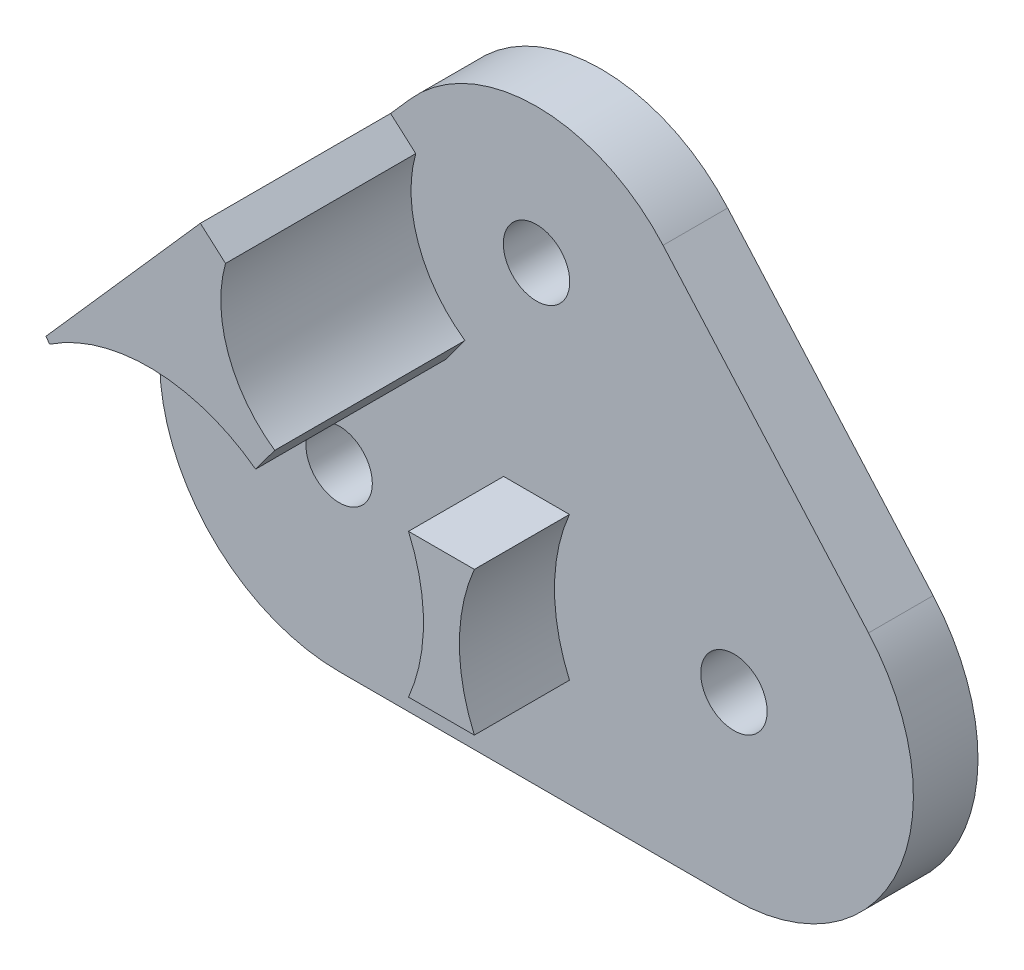
ISO-10303-21;
HEADER;
FILE_DESCRIPTION(('STEP AP214'),'2;1');
FILE_NAME('part.step','',(''),(''),'','','');
FILE_SCHEMA(('AUTOMOTIVE_DESIGN { 1 0 10303 214 1 1 1 1 }'));
ENDSEC;
DATA;
#1=APPLICATION_CONTEXT('core data for automotive mechanical design processes');
#2=APPLICATION_PROTOCOL_DEFINITION('international standard','automotive_design',2000,#1);
#3=PRODUCT_CONTEXT('',#1,'mechanical');
#4=PRODUCT('Part','Part','',(#3));
#5=PRODUCT_RELATED_PRODUCT_CATEGORY('part','',(#4));
#6=PRODUCT_DEFINITION_FORMATION('','',#4);
#7=PRODUCT_DEFINITION_CONTEXT('part definition',#1,'design');
#8=PRODUCT_DEFINITION('design','',#6,#7);
#9=PRODUCT_DEFINITION_SHAPE('','',#8);
#10=(LENGTH_UNIT() NAMED_UNIT(*) SI_UNIT(.MILLI.,.METRE.));
#11=(NAMED_UNIT(*) PLANE_ANGLE_UNIT() SI_UNIT($,.RADIAN.));
#12=(NAMED_UNIT(*) SI_UNIT($,.STERADIAN.) SOLID_ANGLE_UNIT());
#13=UNCERTAINTY_MEASURE_WITH_UNIT(LENGTH_MEASURE(1.E-05),#10,'distance_accuracy_value','');
#14=(GEOMETRIC_REPRESENTATION_CONTEXT(3) GLOBAL_UNCERTAINTY_ASSIGNED_CONTEXT((#13)) GLOBAL_UNIT_ASSIGNED_CONTEXT((#10,
#11,#12)) REPRESENTATION_CONTEXT('',''));
#15=CARTESIAN_POINT('',(0.,0.,0.));
#16=DIRECTION('',(0.,0.,1.));
#17=DIRECTION('',(1.,0.,0.));
#18=AXIS2_PLACEMENT_3D('',#15,#16,#17);
#19=CARTESIAN_POINT('',(2.45,3.25,1.8));
#20=DIRECTION('',(0.,0.,-1.));
#21=DIRECTION('',(-1.,0.,0.));
#22=AXIS2_PLACEMENT_3D('',#19,#20,#21);
#23=CYLINDRICAL_SURFACE('',#22,5.);
#24=DIRECTION('',(0.,0.,1.));
#25=VECTOR('',#24,1.);
#26=CARTESIAN_POINT('',(6.19964646231453,6.5575899696988,0.));
#27=LINE('',#26,#25);
#28=CARTESIAN_POINT('',(6.19964646231453,6.5575899696988,0.));
#29=VERTEX_POINT('',#28);
#30=CARTESIAN_POINT('',(6.19964646231453,6.5575899696988,1.8));
#31=VERTEX_POINT('',#30);
#32=EDGE_CURVE('E243',#29,#31,#27,.T.);
#33=ORIENTED_EDGE('',*,*,#32,.T.);
#34=CARTESIAN_POINT('',(2.45,3.25,1.8));
#35=DIRECTION('',(0.,0.,1.));
#36=DIRECTION('',(1.,0.,0.));
#37=AXIS2_PLACEMENT_3D('',#34,#35,#36);
#38=CIRCLE('',#37,5.);
#39=CARTESIAN_POINT('',(2.45,-1.75,1.8));
#40=VERTEX_POINT('',#39);
#41=EDGE_CURVE('E262',#40,#31,#38,.T.);
#42=ORIENTED_EDGE('',*,*,#41,.F.);
#43=DIRECTION('',(0.,0.,-1.));
#44=VECTOR('',#43,1.);
#45=CARTESIAN_POINT('',(2.45,-1.75,1.8));
#46=LINE('',#45,#44);
#47=CARTESIAN_POINT('',(2.45,-1.75,0.));
#48=VERTEX_POINT('',#47);
#49=EDGE_CURVE('E46',#40,#48,#46,.T.);
#50=ORIENTED_EDGE('',*,*,#49,.T.);
#51=CARTESIAN_POINT('',(2.45,3.25,0.));
#52=DIRECTION('',(0.,0.,1.));
#53=DIRECTION('',(1.,0.,0.));
#54=AXIS2_PLACEMENT_3D('',#51,#52,#53);
#55=CIRCLE('',#54,5.);
#56=EDGE_CURVE('E263',#48,#29,#55,.T.);
#57=ORIENTED_EDGE('',*,*,#56,.T.);
#58=EDGE_LOOP('',(#33,#42,#50,#57));
#59=FACE_BOUND('',#58,.T.);
#60=ADVANCED_FACE('F36',(#59),#23,.T.);
#61=CARTESIAN_POINT('',(-8.55,3.25,1.8));
#62=DIRECTION('',(0.,0.,1.));
#63=DIRECTION('',(1.,0.,0.));
#64=AXIS2_PLACEMENT_3D('',#61,#62,#63);
#65=PLANE('',#64);
#66=CARTESIAN_POINT('',(2.45,3.25,1.8));
#67=DIRECTION('',(0.,0.,1.));
#68=DIRECTION('',(1.,0.,0.));
#69=AXIS2_PLACEMENT_3D('',#66,#67,#68);
#70=CIRCLE('',#69,5.);
#71=CARTESIAN_POINT('',(-2.13257569495584,5.25,1.8));
#72=VERTEX_POINT('',#71);
#73=CARTESIAN_POINT('',(-2.13257569495584,1.25,1.8));
#74=VERTEX_POINT('',#73);
#75=EDGE_CURVE('E157',#72,#74,#70,.T.);
#76=ORIENTED_EDGE('',*,*,#75,.T.);
#77=DIRECTION('',(1.,0.,0.));
#78=VECTOR('',#77,1.);
#79=CARTESIAN_POINT('',(0.,1.25,1.8));
#80=LINE('',#79,#78);
#81=CARTESIAN_POINT('',(-3.96742430504416,1.25,1.8));
#82=VERTEX_POINT('',#81);
#83=EDGE_CURVE('E173',#82,#74,#80,.T.);
#84=ORIENTED_EDGE('',*,*,#83,.F.);
#85=CARTESIAN_POINT('',(-8.55,3.25,1.8));
#86=DIRECTION('',(0.,0.,1.));
#87=DIRECTION('',(1.,0.,0.));
#88=AXIS2_PLACEMENT_3D('',#85,#86,#87);
#89=CIRCLE('',#88,5.);
#90=CARTESIAN_POINT('',(-3.96742430504416,5.25,1.8));
#91=VERTEX_POINT('',#90);
#92=EDGE_CURVE('E54',#82,#91,#89,.T.);
#93=ORIENTED_EDGE('',*,*,#92,.T.);
#94=DIRECTION('',(1.,0.,0.));
#95=VECTOR('',#94,1.);
#96=CARTESIAN_POINT('',(0.,5.25,1.8));
#97=LINE('',#96,#95);
#98=EDGE_CURVE('E183',#91,#72,#97,.T.);
#99=ORIENTED_EDGE('',*,*,#98,.T.);
#100=EDGE_LOOP('',(#76,#84,#93,#99));
#101=FACE_BOUND('',#100,.T.);
#102=DIRECTION('',(0.553999449794571,-0.832517032634956,0.));
#103=VECTOR('',#102,1.);
#104=CARTESIAN_POINT('',(-4.42692798373431,-2.94590449339717,1.8));
#105=LINE('',#104,#103);
#106=CARTESIAN_POINT('',(-11.4169416991755,7.55826744867719,1.8));
#107=VERTEX_POINT('',#106);
#108=CARTESIAN_POINT('',(-11.3199972489729,7.41258516317478,1.8));
#109=VERTEX_POINT('',#108);
#110=EDGE_CURVE('E40',#107,#109,#105,.T.);
#111=ORIENTED_EDGE('',*,*,#110,.F.);
#112=DIRECTION('',(-0.661517993939761,-0.749929292462906,0.));
#113=VECTOR('',#112,1.);
#114=CARTESIAN_POINT('',(-12.2996464623145,6.5575899696988,1.8));
#115=LINE('',#114,#113);
#116=CARTESIAN_POINT('',(-12.2996464623145,6.5575899696988,1.8));
#117=VERTEX_POINT('',#116);
#118=EDGE_CURVE('E249',#107,#117,#115,.T.);
#119=ORIENTED_EDGE('',*,*,#118,.T.);
#120=CARTESIAN_POINT('',(-8.55,3.25,1.8));
#121=DIRECTION('',(0.,0.,1.));
#122=DIRECTION('',(1.,0.,0.));
#123=AXIS2_PLACEMENT_3D('',#120,#121,#122);
#124=CIRCLE('',#123,5.);
#125=CARTESIAN_POINT('',(-8.55,-1.75,1.8));
#126=VERTEX_POINT('',#125);
#127=EDGE_CURVE('E266',#117,#126,#124,.T.);
#128=ORIENTED_EDGE('',*,*,#127,.T.);
#129=DIRECTION('',(1.,0.,0.));
#130=VECTOR('',#129,1.);
#131=CARTESIAN_POINT('',(-8.55,-1.75,1.8));
#132=LINE('',#131,#130);
#133=EDGE_CURVE('E274',#126,#40,#132,.T.);
#134=ORIENTED_EDGE('',*,*,#133,.T.);
#135=ORIENTED_EDGE('',*,*,#41,.T.);
#136=DIRECTION('',(-0.661517993939761,0.749929292462906,0.));
#137=VECTOR('',#136,1.);
#138=CARTESIAN_POINT('',(6.19964646231453,6.5575899696988,1.8));
#139=LINE('',#138,#137);
#140=CARTESIAN_POINT('',(0.474920939683804,13.0474200273249,1.8));
#141=VERTEX_POINT('',#140);
#142=EDGE_CURVE('E231',#31,#141,#139,.T.);
#143=ORIENTED_EDGE('',*,*,#142,.T.);
#144=CARTESIAN_POINT('',(-3.05,9.93806204884429,1.8));
#145=DIRECTION('',(0.,0.,1.));
#146=DIRECTION('',(1.,0.,0.));
#147=AXIS2_PLACEMENT_3D('',#144,#145,#146);
#148=CIRCLE('',#147,4.70033771864987);
#149=CARTESIAN_POINT('',(-6.57492093968381,13.0474200273249,1.8));
#150=VERTEX_POINT('',#149);
#151=EDGE_CURVE('E246',#141,#150,#148,.T.);
#152=ORIENTED_EDGE('',*,*,#151,.T.);
#153=CARTESIAN_POINT('',(-7.11620923440593,12.4337890277177,1.8));
#154=VERTEX_POINT('',#153);
#155=EDGE_CURVE('E238',#150,#154,#115,.T.);
#156=ORIENTED_EDGE('',*,*,#155,.T.);
#157=DIRECTION('',(0.749929292462906,-0.661517993939761,0.));
#158=VECTOR('',#157,1.);
#159=CARTESIAN_POINT('',(3.05420354021843,3.46239515921963,1.8));
#160=LINE('',#159,#158);
#161=CARTESIAN_POINT('',(-6.41511562514768,11.8153493393074,1.8));
#162=VERTEX_POINT('',#161);
#163=EDGE_CURVE('E215',#154,#162,#160,.T.);
#164=ORIENTED_EDGE('',*,*,#163,.T.);
#165=CARTESIAN_POINT('',(-3.05,10.8630620488443,1.8));
#166=DIRECTION('',(0.,0.,1.));
#167=DIRECTION('',(1.,0.,0.));
#168=AXIS2_PLACEMENT_3D('',#165,#166,#167);
#169=CIRCLE('',#168,3.49726382393304);
#170=CARTESIAN_POINT('',(-5.04438407694558,7.99020869236807,1.8));
#171=VERTEX_POINT('',#170);
#172=EDGE_CURVE('E213',#162,#171,#169,.T.);
#173=ORIENTED_EDGE('',*,*,#172,.T.);
#174=DIRECTION('',(-0.594608600812531,-0.804015305724813,0.));
#175=VECTOR('',#174,1.);
#176=CARTESIAN_POINT('',(-7.08080908312888,5.23660426805478,1.8));
#177=LINE('',#176,#175);
#178=CARTESIAN_POINT('',(-5.57695699593735,7.27007652862406,1.8));
#179=VERTEX_POINT('',#178);
#180=EDGE_CURVE('E210',#171,#179,#177,.T.);
#181=ORIENTED_EDGE('',*,*,#180,.T.);
#182=CARTESIAN_POINT('',(-8.55,3.25,1.8));
#183=DIRECTION('',(0.,0.,1.));
#184=DIRECTION('',(1.,0.,0.));
#185=AXIS2_PLACEMENT_3D('',#182,#183,#184);
#186=CIRCLE('',#185,5.);
#187=EDGE_CURVE('E62',#179,#109,#186,.T.);
#188=ORIENTED_EDGE('',*,*,#187,.T.);
#189=EDGE_LOOP('',(#111,#119,#128,#134,#135,#143,#152,#156,#164,#173,#181,#188));
#190=FACE_BOUND('',#189,.T.);
#191=CARTESIAN_POINT('',(-8.55,3.25,1.8));
#192=DIRECTION('',(0.,0.,1.));
#193=DIRECTION('',(1.,0.,0.));
#194=AXIS2_PLACEMENT_3D('',#191,#192,#193);
#195=CIRCLE('',#194,0.925000000000001);
#196=CARTESIAN_POINT('',(-7.625,3.25,1.8));
#197=VERTEX_POINT('',#196);
#198=EDGE_CURVE('E271',#197,#197,#195,.T.);
#199=ORIENTED_EDGE('',*,*,#198,.F.);
#200=EDGE_LOOP('',(#199));
#201=FACE_BOUND('',#200,.T.);
#202=CARTESIAN_POINT('',(2.45,3.25,1.8));
#203=DIRECTION('',(0.,0.,1.));
#204=DIRECTION('',(1.,0.,0.));
#205=AXIS2_PLACEMENT_3D('',#202,#203,#204);
#206=CIRCLE('',#205,0.925);
#207=CARTESIAN_POINT('',(3.375,3.25,1.8));
#208=VERTEX_POINT('',#207);
#209=EDGE_CURVE('E280',#208,#208,#206,.T.);
#210=ORIENTED_EDGE('',*,*,#209,.F.);
#211=EDGE_LOOP('',(#210));
#212=FACE_BOUND('',#211,.T.);
#213=CARTESIAN_POINT('',(-3.05,10.8630620488443,1.8));
#214=DIRECTION('',(0.,0.,1.));
#215=DIRECTION('',(1.,0.,0.));
#216=AXIS2_PLACEMENT_3D('',#213,#214,#215);
#217=CIRCLE('',#216,0.925);
#218=CARTESIAN_POINT('',(-2.125,10.8630620488443,1.8));
#219=VERTEX_POINT('',#218);
#220=EDGE_CURVE('E227',#219,#219,#217,.T.);
#221=ORIENTED_EDGE('',*,*,#220,.F.);
#222=EDGE_LOOP('',(#221));
#223=FACE_BOUND('',#222,.T.);
#224=ADVANCED_FACE('F309',(#101,#190,#201,#212,#223),#65,.T.);
#225=CARTESIAN_POINT('',(-8.55,3.25,0.));
#226=DIRECTION('',(0.,0.,1.));
#227=DIRECTION('',(1.,0.,0.));
#228=AXIS2_PLACEMENT_3D('',#225,#226,#227);
#229=PLANE('',#228);
#230=CARTESIAN_POINT('',(-8.55,3.25,0.));
#231=DIRECTION('',(0.,0.,1.));
#232=DIRECTION('',(1.,0.,0.));
#233=AXIS2_PLACEMENT_3D('',#230,#231,#232);
#234=CIRCLE('',#233,5.);
#235=CARTESIAN_POINT('',(-12.2996464623145,6.5575899696988,0.));
#236=VERTEX_POINT('',#235);
#237=CARTESIAN_POINT('',(-8.55,-1.75,0.));
#238=VERTEX_POINT('',#237);
#239=EDGE_CURVE('E269',#236,#238,#234,.T.);
#240=ORIENTED_EDGE('',*,*,#239,.F.);
#241=DIRECTION('',(-0.661517993939761,-0.749929292462906,0.));
#242=VECTOR('',#241,1.);
#243=CARTESIAN_POINT('',(-12.2996464623145,6.5575899696988,0.));
#244=LINE('',#243,#242);
#245=CARTESIAN_POINT('',(-6.57492093968381,13.0474200273249,0.));
#246=VERTEX_POINT('',#245);
#247=EDGE_CURVE('E241',#246,#236,#244,.T.);
#248=ORIENTED_EDGE('',*,*,#247,.F.);
#249=CARTESIAN_POINT('',(-3.05,9.93806204884429,0.));
#250=DIRECTION('',(0.,0.,1.));
#251=DIRECTION('',(1.,0.,0.));
#252=AXIS2_PLACEMENT_3D('',#249,#250,#251);
#253=CIRCLE('',#252,4.70033771864987);
#254=CARTESIAN_POINT('',(0.474920939683804,13.0474200273249,0.));
#255=VERTEX_POINT('',#254);
#256=EDGE_CURVE('E237',#255,#246,#253,.T.);
#257=ORIENTED_EDGE('',*,*,#256,.F.);
#258=DIRECTION('',(-0.661517993939761,0.749929292462906,0.));
#259=VECTOR('',#258,1.);
#260=CARTESIAN_POINT('',(6.19964646231453,6.5575899696988,0.));
#261=LINE('',#260,#259);
#262=EDGE_CURVE('E234',#29,#255,#261,.T.);
#263=ORIENTED_EDGE('',*,*,#262,.F.);
#264=ORIENTED_EDGE('',*,*,#56,.F.);
#265=DIRECTION('',(1.,0.,0.));
#266=VECTOR('',#265,1.);
#267=CARTESIAN_POINT('',(-8.55,-1.75,0.));
#268=LINE('',#267,#266);
#269=EDGE_CURVE('E267',#238,#48,#268,.T.);
#270=ORIENTED_EDGE('',*,*,#269,.F.);
#271=EDGE_LOOP('',(#240,#248,#257,#263,#264,#270));
#272=FACE_BOUND('',#271,.T.);
#273=CARTESIAN_POINT('',(-8.55,3.25,0.));
#274=DIRECTION('',(0.,0.,1.));
#275=DIRECTION('',(1.,0.,0.));
#276=AXIS2_PLACEMENT_3D('',#273,#274,#275);
#277=CIRCLE('',#276,0.925000000000001);
#278=CARTESIAN_POINT('',(-7.625,3.25,0.));
#279=VERTEX_POINT('',#278);
#280=EDGE_CURVE('E277',#279,#279,#277,.T.);
#281=ORIENTED_EDGE('',*,*,#280,.T.);
#282=EDGE_LOOP('',(#281));
#283=FACE_BOUND('',#282,.T.);
#284=CARTESIAN_POINT('',(2.45,3.25,0.));
#285=DIRECTION('',(0.,0.,1.));
#286=DIRECTION('',(1.,0.,0.));
#287=AXIS2_PLACEMENT_3D('',#284,#285,#286);
#288=CIRCLE('',#287,0.925);
#289=CARTESIAN_POINT('',(3.375,3.25,0.));
#290=VERTEX_POINT('',#289);
#291=EDGE_CURVE('E283',#290,#290,#288,.T.);
#292=ORIENTED_EDGE('',*,*,#291,.T.);
#293=EDGE_LOOP('',(#292));
#294=FACE_BOUND('',#293,.T.);
#295=CARTESIAN_POINT('',(-3.05,10.8630620488443,0.));
#296=DIRECTION('',(0.,0.,1.));
#297=DIRECTION('',(1.,0.,0.));
#298=AXIS2_PLACEMENT_3D('',#295,#296,#297);
#299=CIRCLE('',#298,0.925);
#300=CARTESIAN_POINT('',(-2.125,10.8630620488443,0.));
#301=VERTEX_POINT('',#300);
#302=EDGE_CURVE('E228',#301,#301,#299,.T.);
#303=ORIENTED_EDGE('',*,*,#302,.T.);
#304=EDGE_LOOP('',(#303));
#305=FACE_BOUND('',#304,.T.);
#306=ADVANCED_FACE('F338',(#272,#283,#294,#305),#229,.F.);
#307=CARTESIAN_POINT('',(-8.55,3.25,1.8));
#308=DIRECTION('',(0.,0.,-1.));
#309=DIRECTION('',(-1.,0.,0.));
#310=AXIS2_PLACEMENT_3D('',#307,#308,#309);
#311=CYLINDRICAL_SURFACE('',#310,5.);
#312=ORIENTED_EDGE('',*,*,#127,.F.);
#313=DIRECTION('',(0.,0.,1.));
#314=VECTOR('',#313,1.);
#315=CARTESIAN_POINT('',(-12.2996464623145,6.5575899696988,0.));
#316=LINE('',#315,#314);
#317=EDGE_CURVE('E252',#236,#117,#316,.T.);
#318=ORIENTED_EDGE('',*,*,#317,.F.);
#319=ORIENTED_EDGE('',*,*,#239,.T.);
#320=DIRECTION('',(0.,0.,-1.));
#321=VECTOR('',#320,1.);
#322=CARTESIAN_POINT('',(-8.55,-1.75,1.8));
#323=LINE('',#322,#321);
#324=EDGE_CURVE('E11',#126,#238,#323,.T.);
#325=ORIENTED_EDGE('',*,*,#324,.F.);
#326=EDGE_LOOP('',(#312,#318,#319,#325));
#327=FACE_BOUND('',#326,.T.);
#328=ADVANCED_FACE('F38',(#327),#311,.T.);
#329=CARTESIAN_POINT('',(-8.55,-1.75,1.8));
#330=DIRECTION('',(0.,1.,0.));
#331=DIRECTION('',(0.,0.,1.));
#332=AXIS2_PLACEMENT_3D('',#329,#330,#331);
#333=PLANE('',#332);
#334=ORIENTED_EDGE('',*,*,#269,.T.);
#335=ORIENTED_EDGE('',*,*,#49,.F.);
#336=ORIENTED_EDGE('',*,*,#133,.F.);
#337=ORIENTED_EDGE('',*,*,#324,.T.);
#338=EDGE_LOOP('',(#334,#335,#336,#337));
#339=FACE_BOUND('',#338,.T.);
#340=ADVANCED_FACE('F313',(#339),#333,.F.);
#341=CARTESIAN_POINT('',(-8.55,3.25,1.8));
#342=DIRECTION('',(0.,0.,-1.));
#343=DIRECTION('',(-1.,0.,0.));
#344=AXIS2_PLACEMENT_3D('',#341,#342,#343);
#345=CYLINDRICAL_SURFACE('',#344,0.925000000000001);
#346=ORIENTED_EDGE('',*,*,#198,.T.);
#347=EDGE_LOOP('',(#346));
#348=FACE_BOUND('',#347,.T.);
#349=ORIENTED_EDGE('',*,*,#280,.F.);
#350=EDGE_LOOP('',(#349));
#351=FACE_BOUND('',#350,.T.);
#352=ADVANCED_FACE('F343',(#348,#351),#345,.F.);
#353=CARTESIAN_POINT('',(2.45,3.25,1.8));
#354=DIRECTION('',(0.,0.,-1.));
#355=DIRECTION('',(-1.,0.,0.));
#356=AXIS2_PLACEMENT_3D('',#353,#354,#355);
#357=CYLINDRICAL_SURFACE('',#356,0.925);
#358=ORIENTED_EDGE('',*,*,#209,.T.);
#359=EDGE_LOOP('',(#358));
#360=FACE_BOUND('',#359,.T.);
#361=ORIENTED_EDGE('',*,*,#291,.F.);
#362=EDGE_LOOP('',(#361));
#363=FACE_BOUND('',#362,.T.);
#364=ADVANCED_FACE('F331',(#360,#363),#357,.F.);
#365=CARTESIAN_POINT('',(-12.2996464623145,6.5575899696988,0.));
#366=DIRECTION('',(-0.749929292462906,0.661517993939761,0.));
#367=DIRECTION('',(-0.661517993939761,-0.749929292462906,0.));
#368=AXIS2_PLACEMENT_3D('',#365,#366,#367);
#369=PLANE('',#368);
#370=ORIENTED_EDGE('',*,*,#155,.F.);
#371=DIRECTION('',(0.,0.,1.));
#372=VECTOR('',#371,1.);
#373=CARTESIAN_POINT('',(-6.57492093968381,13.0474200273249,0.));
#374=LINE('',#373,#372);
#375=EDGE_CURVE('E291',#246,#150,#374,.T.);
#376=ORIENTED_EDGE('',*,*,#375,.F.);
#377=ORIENTED_EDGE('',*,*,#247,.T.);
#378=ORIENTED_EDGE('',*,*,#317,.T.);
#379=ORIENTED_EDGE('',*,*,#118,.F.);
#380=DIRECTION('',(0.,0.,-1.));
#381=VECTOR('',#380,1.);
#382=CARTESIAN_POINT('',(-11.4169416991755,7.55826744867719,7.1));
#383=LINE('',#382,#381);
#384=CARTESIAN_POINT('',(-11.4169416991755,7.55826744867719,7.1));
#385=VERTEX_POINT('',#384);
#386=EDGE_CURVE('E219',#385,#107,#383,.T.);
#387=ORIENTED_EDGE('',*,*,#386,.F.);
#388=DIRECTION('',(-0.661517993939761,-0.749929292462906,0.));
#389=VECTOR('',#388,1.);
#390=CARTESIAN_POINT('',(-10.1704127746244,8.97139386849808,7.1));
#391=LINE('',#390,#389);
#392=CARTESIAN_POINT('',(-7.11620923440593,12.4337890277177,7.1));
#393=VERTEX_POINT('',#392);
#394=EDGE_CURVE('E204',#393,#385,#391,.T.);
#395=ORIENTED_EDGE('',*,*,#394,.F.);
#396=DIRECTION('',(0.,0.,-1.));
#397=VECTOR('',#396,1.);
#398=CARTESIAN_POINT('',(-7.11620923440593,12.4337890277177,7.1));
#399=LINE('',#398,#397);
#400=EDGE_CURVE('E223',#393,#154,#399,.T.);
#401=ORIENTED_EDGE('',*,*,#400,.T.);
#402=EDGE_LOOP('',(#370,#376,#377,#378,#379,#387,#395,#401));
#403=FACE_BOUND('',#402,.T.);
#404=ADVANCED_FACE('F300',(#403),#369,.T.);
#405=CARTESIAN_POINT('',(-3.05,9.93806204884429,0.));
#406=DIRECTION('',(0.,0.,1.));
#407=DIRECTION('',(1.,0.,0.));
#408=AXIS2_PLACEMENT_3D('',#405,#406,#407);
#409=CYLINDRICAL_SURFACE('',#408,4.70033771864987);
#410=ORIENTED_EDGE('',*,*,#151,.F.);
#411=DIRECTION('',(0.,0.,1.));
#412=VECTOR('',#411,1.);
#413=CARTESIAN_POINT('',(0.474920939683804,13.0474200273249,0.));
#414=LINE('',#413,#412);
#415=EDGE_CURVE('E290',#255,#141,#414,.T.);
#416=ORIENTED_EDGE('',*,*,#415,.F.);
#417=ORIENTED_EDGE('',*,*,#256,.T.);
#418=ORIENTED_EDGE('',*,*,#375,.T.);
#419=EDGE_LOOP('',(#410,#416,#417,#418));
#420=FACE_BOUND('',#419,.T.);
#421=ADVANCED_FACE('F322',(#420),#409,.T.);
#422=CARTESIAN_POINT('',(6.19964646231453,6.5575899696988,0.));
#423=DIRECTION('',(0.749929292462906,0.661517993939761,0.));
#424=DIRECTION('',(-0.661517993939761,0.749929292462906,0.));
#425=AXIS2_PLACEMENT_3D('',#422,#423,#424);
#426=PLANE('',#425);
#427=ORIENTED_EDGE('',*,*,#142,.F.);
#428=ORIENTED_EDGE('',*,*,#32,.F.);
#429=ORIENTED_EDGE('',*,*,#262,.T.);
#430=ORIENTED_EDGE('',*,*,#415,.T.);
#431=EDGE_LOOP('',(#427,#428,#429,#430));
#432=FACE_BOUND('',#431,.T.);
#433=ADVANCED_FACE('F319',(#432),#426,.T.);
#434=CARTESIAN_POINT('',(-3.05,10.8630620488443,0.));
#435=DIRECTION('',(0.,0.,1.));
#436=DIRECTION('',(1.,0.,0.));
#437=AXIS2_PLACEMENT_3D('',#434,#435,#436);
#438=CYLINDRICAL_SURFACE('',#437,0.925);
#439=ORIENTED_EDGE('',*,*,#302,.F.);
#440=EDGE_LOOP('',(#439));
#441=FACE_BOUND('',#440,.T.);
#442=ORIENTED_EDGE('',*,*,#220,.T.);
#443=EDGE_LOOP('',(#442));
#444=FACE_BOUND('',#443,.T.);
#445=ADVANCED_FACE('F329',(#441,#444),#438,.F.);
#446=CARTESIAN_POINT('',(-8.55,3.25,7.1));
#447=DIRECTION('',(0.,0.,-1.));
#448=DIRECTION('',(-1.,0.,0.));
#449=AXIS2_PLACEMENT_3D('',#446,#447,#448);
#450=CYLINDRICAL_SURFACE('',#449,5.);
#451=ORIENTED_EDGE('',*,*,#187,.F.);
#452=DIRECTION('',(0.,0.,-1.));
#453=VECTOR('',#452,1.);
#454=CARTESIAN_POINT('',(-5.57695699593735,7.27007652862406,7.1));
#455=LINE('',#454,#453);
#456=CARTESIAN_POINT('',(-5.57695699593735,7.27007652862406,7.1));
#457=VERTEX_POINT('',#456);
#458=EDGE_CURVE('E225',#457,#179,#455,.T.);
#459=ORIENTED_EDGE('',*,*,#458,.F.);
#460=CARTESIAN_POINT('',(-8.55,3.25,7.1));
#461=DIRECTION('',(0.,0.,1.));
#462=DIRECTION('',(1.,0.,0.));
#463=AXIS2_PLACEMENT_3D('',#460,#461,#462);
#464=CIRCLE('',#463,5.);
#465=CARTESIAN_POINT('',(-11.3199972489729,7.41258516317478,7.1));
#466=VERTEX_POINT('',#465);
#467=EDGE_CURVE('E192',#457,#466,#464,.T.);
#468=ORIENTED_EDGE('',*,*,#467,.T.);
#469=DIRECTION('',(0.,0.,-1.));
#470=VECTOR('',#469,1.);
#471=CARTESIAN_POINT('',(-11.3199972489729,7.41258516317478,7.1));
#472=LINE('',#471,#470);
#473=EDGE_CURVE('E208',#466,#109,#472,.T.);
#474=ORIENTED_EDGE('',*,*,#473,.T.);
#475=EDGE_LOOP('',(#451,#459,#468,#474));
#476=FACE_BOUND('',#475,.T.);
#477=ADVANCED_FACE('F365',(#476),#450,.F.);
#478=CARTESIAN_POINT('',(-7.08080908312888,5.23660426805478,7.1));
#479=DIRECTION('',(0.804015305724813,-0.594608600812531,0.));
#480=DIRECTION('',(0.594608600812531,0.804015305724813,0.));
#481=AXIS2_PLACEMENT_3D('',#478,#479,#480);
#482=PLANE('',#481);
#483=ORIENTED_EDGE('',*,*,#180,.F.);
#484=DIRECTION('',(0.,0.,-1.));
#485=VECTOR('',#484,1.);
#486=CARTESIAN_POINT('',(-5.04438407694558,7.99020869236807,7.1));
#487=LINE('',#486,#485);
#488=CARTESIAN_POINT('',(-5.04438407694558,7.99020869236807,7.1));
#489=VERTEX_POINT('',#488);
#490=EDGE_CURVE('E222',#489,#171,#487,.T.);
#491=ORIENTED_EDGE('',*,*,#490,.F.);
#492=DIRECTION('',(-0.594608600812531,-0.804015305724813,0.));
#493=VECTOR('',#492,1.);
#494=CARTESIAN_POINT('',(-7.08080908312888,5.23660426805478,7.1));
#495=LINE('',#494,#493);
#496=EDGE_CURVE('E195',#489,#457,#495,.T.);
#497=ORIENTED_EDGE('',*,*,#496,.T.);
#498=ORIENTED_EDGE('',*,*,#458,.T.);
#499=EDGE_LOOP('',(#483,#491,#497,#498));
#500=FACE_BOUND('',#499,.T.);
#501=ADVANCED_FACE('F372',(#500),#482,.T.);
#502=CARTESIAN_POINT('',(-3.05,10.8630620488443,7.1));
#503=DIRECTION('',(0.,0.,-1.));
#504=DIRECTION('',(-1.,0.,0.));
#505=AXIS2_PLACEMENT_3D('',#502,#503,#504);
#506=CYLINDRICAL_SURFACE('',#505,3.49726382393304);
#507=ORIENTED_EDGE('',*,*,#172,.F.);
#508=DIRECTION('',(0.,0.,-1.));
#509=VECTOR('',#508,1.);
#510=CARTESIAN_POINT('',(-6.41511562514768,11.8153493393074,7.1));
#511=LINE('',#510,#509);
#512=CARTESIAN_POINT('',(-6.41511562514768,11.8153493393074,7.1));
#513=VERTEX_POINT('',#512);
#514=EDGE_CURVE('E220',#513,#162,#511,.T.);
#515=ORIENTED_EDGE('',*,*,#514,.F.);
#516=CARTESIAN_POINT('',(-3.05,10.8630620488443,7.1));
#517=DIRECTION('',(0.,0.,1.));
#518=DIRECTION('',(1.,0.,0.));
#519=AXIS2_PLACEMENT_3D('',#516,#517,#518);
#520=CIRCLE('',#519,3.49726382393304);
#521=EDGE_CURVE('E198',#513,#489,#520,.T.);
#522=ORIENTED_EDGE('',*,*,#521,.T.);
#523=ORIENTED_EDGE('',*,*,#490,.T.);
#524=EDGE_LOOP('',(#507,#515,#522,#523));
#525=FACE_BOUND('',#524,.T.);
#526=ADVANCED_FACE('F377',(#525),#506,.F.);
#527=CARTESIAN_POINT('',(3.05420354021843,3.46239515921963,7.1));
#528=DIRECTION('',(0.661517993939761,0.749929292462906,0.));
#529=DIRECTION('',(-0.749929292462906,0.661517993939761,0.));
#530=AXIS2_PLACEMENT_3D('',#527,#528,#529);
#531=PLANE('',#530);
#532=ORIENTED_EDGE('',*,*,#163,.F.);
#533=ORIENTED_EDGE('',*,*,#400,.F.);
#534=DIRECTION('',(0.749929292462906,-0.661517993939761,0.));
#535=VECTOR('',#534,1.);
#536=CARTESIAN_POINT('',(3.05420354021843,3.46239515921963,7.1));
#537=LINE('',#536,#535);
#538=EDGE_CURVE('E201',#393,#513,#537,.T.);
#539=ORIENTED_EDGE('',*,*,#538,.T.);
#540=ORIENTED_EDGE('',*,*,#514,.T.);
#541=EDGE_LOOP('',(#532,#533,#539,#540));
#542=FACE_BOUND('',#541,.T.);
#543=ADVANCED_FACE('F381',(#542),#531,.T.);
#544=CARTESIAN_POINT('',(-4.42692798373431,-2.94590449339717,7.1));
#545=DIRECTION('',(0.832517032634956,0.553999449794571,0.));
#546=DIRECTION('',(-0.553999449794571,0.832517032634956,0.));
#547=AXIS2_PLACEMENT_3D('',#544,#545,#546);
#548=PLANE('',#547);
#549=ORIENTED_EDGE('',*,*,#110,.T.);
#550=ORIENTED_EDGE('',*,*,#473,.F.);
#551=DIRECTION('',(0.553999449794571,-0.832517032634956,0.));
#552=VECTOR('',#551,1.);
#553=CARTESIAN_POINT('',(-4.42692798373431,-2.94590449339717,7.1));
#554=LINE('',#553,#552);
#555=EDGE_CURVE('E206',#385,#466,#554,.T.);
#556=ORIENTED_EDGE('',*,*,#555,.F.);
#557=ORIENTED_EDGE('',*,*,#386,.T.);
#558=EDGE_LOOP('',(#549,#550,#556,#557));
#559=FACE_BOUND('',#558,.T.);
#560=ADVANCED_FACE('F385',(#559),#548,.F.);
#561=CARTESIAN_POINT('',(0.,0.,7.1));
#562=DIRECTION('',(0.,0.,1.));
#563=DIRECTION('',(1.,0.,0.));
#564=AXIS2_PLACEMENT_3D('',#561,#562,#563);
#565=PLANE('',#564);
#566=ORIENTED_EDGE('',*,*,#467,.F.);
#567=ORIENTED_EDGE('',*,*,#496,.F.);
#568=ORIENTED_EDGE('',*,*,#521,.F.);
#569=ORIENTED_EDGE('',*,*,#538,.F.);
#570=ORIENTED_EDGE('',*,*,#394,.T.);
#571=ORIENTED_EDGE('',*,*,#555,.T.);
#572=EDGE_LOOP('',(#566,#567,#568,#569,#570,#571));
#573=FACE_BOUND('',#572,.T.);
#574=ADVANCED_FACE('F389',(#573),#565,.T.);
#575=CARTESIAN_POINT('',(2.45,3.25,4.45));
#576=DIRECTION('',(0.,0.,-1.));
#577=DIRECTION('',(-1.,0.,0.));
#578=AXIS2_PLACEMENT_3D('',#575,#576,#577);
#579=CYLINDRICAL_SURFACE('',#578,5.);
#580=ORIENTED_EDGE('',*,*,#75,.F.);
#581=DIRECTION('',(0.,0.,-1.));
#582=VECTOR('',#581,1.);
#583=CARTESIAN_POINT('',(-2.13257569495584,5.25,4.45));
#584=LINE('',#583,#582);
#585=CARTESIAN_POINT('',(-2.13257569495584,5.25,4.45));
#586=VERTEX_POINT('',#585);
#587=EDGE_CURVE('E152',#586,#72,#584,.T.);
#588=ORIENTED_EDGE('',*,*,#587,.F.);
#589=CARTESIAN_POINT('',(2.45,3.25,4.45));
#590=DIRECTION('',(0.,0.,1.));
#591=DIRECTION('',(1.,0.,0.));
#592=AXIS2_PLACEMENT_3D('',#589,#590,#591);
#593=CIRCLE('',#592,5.);
#594=CARTESIAN_POINT('',(-2.13257569495584,1.25,4.45));
#595=VERTEX_POINT('',#594);
#596=EDGE_CURVE('E155',#586,#595,#593,.T.);
#597=ORIENTED_EDGE('',*,*,#596,.T.);
#598=DIRECTION('',(0.,0.,-1.));
#599=VECTOR('',#598,1.);
#600=CARTESIAN_POINT('',(-2.13257569495584,1.25,4.45));
#601=LINE('',#600,#599);
#602=EDGE_CURVE('E181',#595,#74,#601,.T.);
#603=ORIENTED_EDGE('',*,*,#602,.T.);
#604=EDGE_LOOP('',(#580,#588,#597,#603));
#605=FACE_BOUND('',#604,.T.);
#606=ADVANCED_FACE('F154',(#605),#579,.F.);
#607=CARTESIAN_POINT('',(0.,5.25,4.45));
#608=DIRECTION('',(0.,1.,0.));
#609=DIRECTION('',(0.,0.,1.));
#610=AXIS2_PLACEMENT_3D('',#607,#608,#609);
#611=PLANE('',#610);
#612=ORIENTED_EDGE('',*,*,#98,.F.);
#613=DIRECTION('',(0.,0.,-1.));
#614=VECTOR('',#613,1.);
#615=CARTESIAN_POINT('',(-3.96742430504416,5.25,4.45));
#616=LINE('',#615,#614);
#617=CARTESIAN_POINT('',(-3.96742430504416,5.25,4.45));
#618=VERTEX_POINT('',#617);
#619=EDGE_CURVE('E162',#618,#91,#616,.T.);
#620=ORIENTED_EDGE('',*,*,#619,.F.);
#621=DIRECTION('',(1.,0.,0.));
#622=VECTOR('',#621,1.);
#623=CARTESIAN_POINT('',(0.,5.25,4.45));
#624=LINE('',#623,#622);
#625=EDGE_CURVE('E168',#618,#586,#624,.T.);
#626=ORIENTED_EDGE('',*,*,#625,.T.);
#627=ORIENTED_EDGE('',*,*,#587,.T.);
#628=EDGE_LOOP('',(#612,#620,#626,#627));
#629=FACE_BOUND('',#628,.T.);
#630=ADVANCED_FACE('F175',(#629),#611,.T.);
#631=CARTESIAN_POINT('',(-8.55,3.25,4.45));
#632=DIRECTION('',(0.,0.,-1.));
#633=DIRECTION('',(-1.,0.,0.));
#634=AXIS2_PLACEMENT_3D('',#631,#632,#633);
#635=CYLINDRICAL_SURFACE('',#634,5.);
#636=ORIENTED_EDGE('',*,*,#92,.F.);
#637=DIRECTION('',(0.,0.,-1.));
#638=VECTOR('',#637,1.);
#639=CARTESIAN_POINT('',(-3.96742430504416,1.25,4.45));
#640=LINE('',#639,#638);
#641=CARTESIAN_POINT('',(-3.96742430504416,1.25,4.45));
#642=VERTEX_POINT('',#641);
#643=EDGE_CURVE('E189',#642,#82,#640,.T.);
#644=ORIENTED_EDGE('',*,*,#643,.F.);
#645=CARTESIAN_POINT('',(-8.55,3.25,4.45));
#646=DIRECTION('',(0.,0.,1.));
#647=DIRECTION('',(1.,0.,0.));
#648=AXIS2_PLACEMENT_3D('',#645,#646,#647);
#649=CIRCLE('',#648,5.);
#650=EDGE_CURVE('E176',#642,#618,#649,.T.);
#651=ORIENTED_EDGE('',*,*,#650,.T.);
#652=ORIENTED_EDGE('',*,*,#619,.T.);
#653=EDGE_LOOP('',(#636,#644,#651,#652));
#654=FACE_BOUND('',#653,.T.);
#655=ADVANCED_FACE('F398',(#654),#635,.F.);
#656=CARTESIAN_POINT('',(0.,1.25,4.45));
#657=DIRECTION('',(0.,1.,0.));
#658=DIRECTION('',(0.,0.,1.));
#659=AXIS2_PLACEMENT_3D('',#656,#657,#658);
#660=PLANE('',#659);
#661=ORIENTED_EDGE('',*,*,#83,.T.);
#662=ORIENTED_EDGE('',*,*,#602,.F.);
#663=DIRECTION('',(1.,0.,0.));
#664=VECTOR('',#663,1.);
#665=CARTESIAN_POINT('',(0.,1.25,4.45));
#666=LINE('',#665,#664);
#667=EDGE_CURVE('E171',#642,#595,#666,.T.);
#668=ORIENTED_EDGE('',*,*,#667,.F.);
#669=ORIENTED_EDGE('',*,*,#643,.T.);
#670=EDGE_LOOP('',(#661,#662,#668,#669));
#671=FACE_BOUND('',#670,.T.);
#672=ADVANCED_FACE('F401',(#671),#660,.F.);
#673=CARTESIAN_POINT('',(0.,0.,4.45));
#674=DIRECTION('',(0.,0.,1.));
#675=DIRECTION('',(1.,0.,0.));
#676=AXIS2_PLACEMENT_3D('',#673,#674,#675);
#677=PLANE('',#676);
#678=ORIENTED_EDGE('',*,*,#596,.F.);
#679=ORIENTED_EDGE('',*,*,#625,.F.);
#680=ORIENTED_EDGE('',*,*,#650,.F.);
#681=ORIENTED_EDGE('',*,*,#667,.T.);
#682=EDGE_LOOP('',(#678,#679,#680,#681));
#683=FACE_BOUND('',#682,.T.);
#684=ADVANCED_FACE('F166',(#683),#677,.T.);
#685=CLOSED_SHELL('',(#60,#224,#306,#328,#340,#352,#364,#404,#421,#433,#445,#477,#501,#526,#543,
#560,#574,#606,#630,#655,#672,#684));
#686=MANIFOLD_SOLID_BREP('B2',#685);
#687=ADVANCED_BREP_SHAPE_REPRESENTATION('',(#18,#686),#14);
#688=SHAPE_DEFINITION_REPRESENTATION(#9,#687);
ENDSEC;
END-ISO-10303-21;
